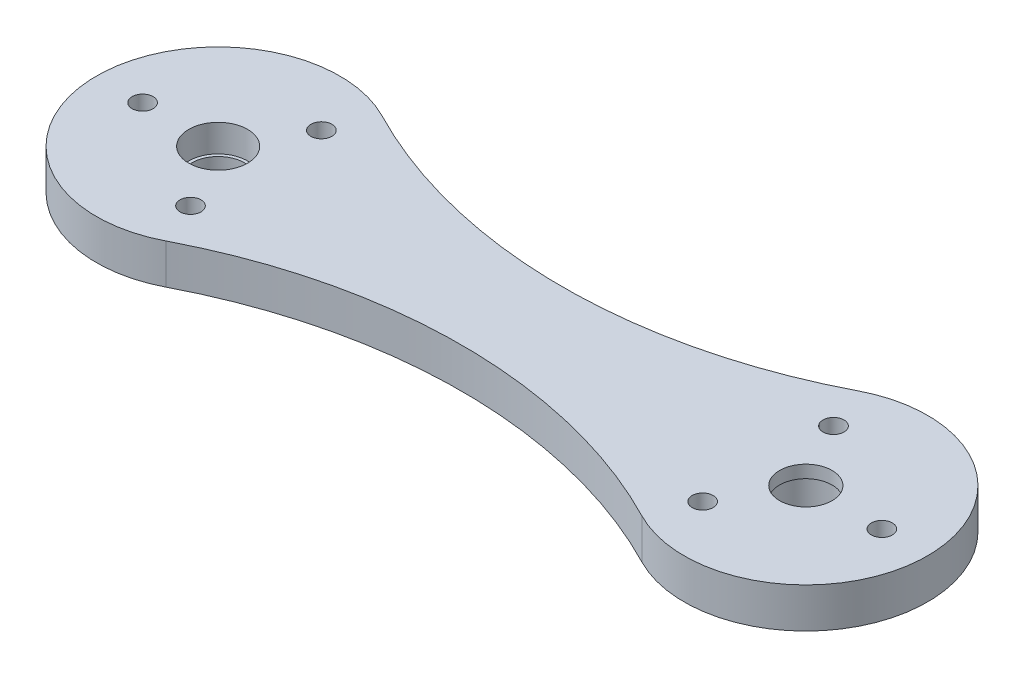
ISO-10303-21;
HEADER;
FILE_DESCRIPTION(('STEP AP214'),'2;1');
FILE_NAME('part.step','',(''),(''),'','','');
FILE_SCHEMA(('AUTOMOTIVE_DESIGN { 1 0 10303 214 1 1 1 1 }'));
ENDSEC;
DATA;
#1=APPLICATION_CONTEXT('core data for automotive mechanical design processes');
#2=APPLICATION_PROTOCOL_DEFINITION('international standard','automotive_design',2000,#1);
#3=PRODUCT_CONTEXT('',#1,'mechanical');
#4=PRODUCT('Part','Part','',(#3));
#5=PRODUCT_RELATED_PRODUCT_CATEGORY('part','',(#4));
#6=PRODUCT_DEFINITION_FORMATION('','',#4);
#7=PRODUCT_DEFINITION_CONTEXT('part definition',#1,'design');
#8=PRODUCT_DEFINITION('design','',#6,#7);
#9=PRODUCT_DEFINITION_SHAPE('','',#8);
#10=(LENGTH_UNIT() NAMED_UNIT(*) SI_UNIT(.MILLI.,.METRE.));
#11=(NAMED_UNIT(*) PLANE_ANGLE_UNIT() SI_UNIT($,.RADIAN.));
#12=(NAMED_UNIT(*) SI_UNIT($,.STERADIAN.) SOLID_ANGLE_UNIT());
#13=UNCERTAINTY_MEASURE_WITH_UNIT(LENGTH_MEASURE(1.E-05),#10,'distance_accuracy_value','');
#14=(GEOMETRIC_REPRESENTATION_CONTEXT(3) GLOBAL_UNCERTAINTY_ASSIGNED_CONTEXT((#13)) GLOBAL_UNIT_ASSIGNED_CONTEXT((#10,
#11,#12)) REPRESENTATION_CONTEXT('',''));
#15=CARTESIAN_POINT('',(0.,0.,0.));
#16=DIRECTION('',(0.,0.,1.));
#17=DIRECTION('',(1.,0.,0.));
#18=AXIS2_PLACEMENT_3D('',#15,#16,#17);
#19=CARTESIAN_POINT('',(0.,4.7625,-67.8088235294118));
#20=DIRECTION('',(0.,-1.,0.));
#21=DIRECTION('',(0.,0.,-1.));
#22=AXIS2_PLACEMENT_3D('',#19,#20,#21);
#23=CYLINDRICAL_SURFACE('',#22,61.8088235294118);
#24=CARTESIAN_POINT('',(0.,0.,-67.8088235294118));
#25=DIRECTION('',(0.,-1.,0.));
#26=DIRECTION('',(0.,0.,1.));
#27=AXIS2_PLACEMENT_3D('',#24,#25,#26);
#28=CIRCLE('',#27,61.8088235294118);
#29=CARTESIAN_POINT('',(28.3493929466179,0.,-12.8848525727501));
#30=VERTEX_POINT('',#29);
#31=CARTESIAN_POINT('',(-28.3493929466178,0.,-12.88485257275));
#32=VERTEX_POINT('',#31);
#33=EDGE_CURVE('E98',#30,#32,#28,.T.);
#34=ORIENTED_EDGE('',*,*,#33,.T.);
#35=DIRECTION('',(0.,-1.,0.));
#36=VECTOR('',#35,1.);
#37=CARTESIAN_POINT('',(-28.3493929466178,4.7625,-12.88485257275));
#38=LINE('',#37,#36);
#39=CARTESIAN_POINT('',(-28.3493929466178,4.7625,-12.88485257275));
#40=VERTEX_POINT('',#39);
#41=EDGE_CURVE('E12',#40,#32,#38,.T.);
#42=ORIENTED_EDGE('',*,*,#41,.F.);
#43=CARTESIAN_POINT('',(0.,4.7625,-67.8088235294118));
#44=DIRECTION('',(0.,-1.,0.));
#45=DIRECTION('',(0.,0.,1.));
#46=AXIS2_PLACEMENT_3D('',#43,#44,#45);
#47=CIRCLE('',#46,61.8088235294118);
#48=CARTESIAN_POINT('',(28.3493929466179,4.7625,-12.8848525727501));
#49=VERTEX_POINT('',#48);
#50=EDGE_CURVE('E85',#49,#40,#47,.T.);
#51=ORIENTED_EDGE('',*,*,#50,.F.);
#52=DIRECTION('',(0.,-1.,0.));
#53=VECTOR('',#52,1.);
#54=CARTESIAN_POINT('',(28.3493929466179,4.7625,-12.8848525727501));
#55=LINE('',#54,#53);
#56=EDGE_CURVE('E94',#49,#30,#55,.T.);
#57=ORIENTED_EDGE('',*,*,#56,.T.);
#58=EDGE_LOOP('',(#34,#42,#51,#57));
#59=FACE_BOUND('',#58,.T.);
#60=ADVANCED_FACE('F33',(#59),#23,.F.);
#61=CARTESIAN_POINT('',(-35.,4.7625,0.));
#62=DIRECTION('',(0.,-1.,0.));
#63=DIRECTION('',(0.,0.,-1.));
#64=AXIS2_PLACEMENT_3D('',#61,#62,#63);
#65=CYLINDRICAL_SURFACE('',#64,14.5);
#66=CARTESIAN_POINT('',(-35.,0.,0.));
#67=DIRECTION('',(0.,1.,0.));
#68=DIRECTION('',(0.,0.,1.));
#69=AXIS2_PLACEMENT_3D('',#66,#67,#68);
#70=CIRCLE('',#69,14.5);
#71=CARTESIAN_POINT('',(-28.3493929466179,0.,12.8848525727501));
#72=VERTEX_POINT('',#71);
#73=EDGE_CURVE('E89',#32,#72,#70,.T.);
#74=ORIENTED_EDGE('',*,*,#73,.T.);
#75=DIRECTION('',(0.,-1.,0.));
#76=VECTOR('',#75,1.);
#77=CARTESIAN_POINT('',(-28.3493929466179,4.7625,12.8848525727501));
#78=LINE('',#77,#76);
#79=CARTESIAN_POINT('',(-28.3493929466179,4.7625,12.8848525727501));
#80=VERTEX_POINT('',#79);
#81=EDGE_CURVE('E42',#80,#72,#78,.T.);
#82=ORIENTED_EDGE('',*,*,#81,.F.);
#83=CARTESIAN_POINT('',(-35.,4.7625,0.));
#84=DIRECTION('',(0.,1.,0.));
#85=DIRECTION('',(0.,0.,1.));
#86=AXIS2_PLACEMENT_3D('',#83,#84,#85);
#87=CIRCLE('',#86,14.5);
#88=EDGE_CURVE('E80',#40,#80,#87,.T.);
#89=ORIENTED_EDGE('',*,*,#88,.F.);
#90=ORIENTED_EDGE('',*,*,#41,.T.);
#91=EDGE_LOOP('',(#74,#82,#89,#90));
#92=FACE_BOUND('',#91,.T.);
#93=ADVANCED_FACE('F88',(#92),#65,.T.);
#94=CARTESIAN_POINT('',(0.,4.7625,67.8088235294118));
#95=DIRECTION('',(0.,-1.,0.));
#96=DIRECTION('',(0.,0.,-1.));
#97=AXIS2_PLACEMENT_3D('',#94,#95,#96);
#98=CYLINDRICAL_SURFACE('',#97,61.8088235294118);
#99=CARTESIAN_POINT('',(0.,0.,67.8088235294118));
#100=DIRECTION('',(0.,-1.,0.));
#101=DIRECTION('',(0.,0.,-1.));
#102=AXIS2_PLACEMENT_3D('',#99,#100,#101);
#103=CIRCLE('',#102,61.8088235294118);
#104=CARTESIAN_POINT('',(28.3493929466178,0.,12.88485257275));
#105=VERTEX_POINT('',#104);
#106=EDGE_CURVE('E67',#72,#105,#103,.T.);
#107=ORIENTED_EDGE('',*,*,#106,.T.);
#108=DIRECTION('',(0.,-1.,0.));
#109=VECTOR('',#108,1.);
#110=CARTESIAN_POINT('',(28.3493929466178,4.7625,12.88485257275));
#111=LINE('',#110,#109);
#112=CARTESIAN_POINT('',(28.3493929466178,4.7625,12.88485257275));
#113=VERTEX_POINT('',#112);
#114=EDGE_CURVE('E90',#113,#105,#111,.T.);
#115=ORIENTED_EDGE('',*,*,#114,.F.);
#116=CARTESIAN_POINT('',(0.,4.7625,67.8088235294118));
#117=DIRECTION('',(0.,-1.,0.));
#118=DIRECTION('',(0.,0.,-1.));
#119=AXIS2_PLACEMENT_3D('',#116,#117,#118);
#120=CIRCLE('',#119,61.8088235294118);
#121=EDGE_CURVE('E83',#80,#113,#120,.T.);
#122=ORIENTED_EDGE('',*,*,#121,.F.);
#123=ORIENTED_EDGE('',*,*,#81,.T.);
#124=EDGE_LOOP('',(#107,#115,#122,#123));
#125=FACE_BOUND('',#124,.T.);
#126=ADVANCED_FACE('F92',(#125),#98,.F.);
#127=CARTESIAN_POINT('',(35.,4.7625,0.));
#128=DIRECTION('',(0.,-1.,0.));
#129=DIRECTION('',(0.,0.,-1.));
#130=AXIS2_PLACEMENT_3D('',#127,#128,#129);
#131=CYLINDRICAL_SURFACE('',#130,14.5);
#132=CARTESIAN_POINT('',(35.,0.,0.));
#133=DIRECTION('',(0.,1.,0.));
#134=DIRECTION('',(0.,0.,1.));
#135=AXIS2_PLACEMENT_3D('',#132,#133,#134);
#136=CIRCLE('',#135,14.5);
#137=EDGE_CURVE('E73',#105,#30,#136,.T.);
#138=ORIENTED_EDGE('',*,*,#137,.T.);
#139=ORIENTED_EDGE('',*,*,#56,.F.);
#140=CARTESIAN_POINT('',(35.,4.7625,0.));
#141=DIRECTION('',(0.,1.,0.));
#142=DIRECTION('',(0.,0.,1.));
#143=AXIS2_PLACEMENT_3D('',#140,#141,#142);
#144=CIRCLE('',#143,14.5);
#145=EDGE_CURVE('E50',#113,#49,#144,.T.);
#146=ORIENTED_EDGE('',*,*,#145,.F.);
#147=ORIENTED_EDGE('',*,*,#114,.T.);
#148=EDGE_LOOP('',(#138,#139,#146,#147));
#149=FACE_BOUND('',#148,.T.);
#150=ADVANCED_FACE('F106',(#149),#131,.T.);
#151=CARTESIAN_POINT('',(17.5,4.7625,-33.9044117647059));
#152=DIRECTION('',(0.,1.,0.));
#153=DIRECTION('',(0.,0.,1.));
#154=AXIS2_PLACEMENT_3D('',#151,#152,#153);
#155=PLANE('',#154);
#156=CARTESIAN_POINT('',(43.9998489219817,4.7625,-0.0521476893535139));
#157=DIRECTION('',(0.,-1.,0.));
#158=DIRECTION('',(0.,0.,-1.));
#159=AXIS2_PLACEMENT_3D('',#156,#157,#158);
#160=CIRCLE('',#159,1.25);
#161=CARTESIAN_POINT('',(43.9998489219817,4.7625,-1.30214768935352));
#162=VERTEX_POINT('',#161);
#163=EDGE_CURVE('E162',#162,#162,#160,.T.);
#164=ORIENTED_EDGE('',*,*,#163,.T.);
#165=EDGE_LOOP('',(#164));
#166=FACE_BOUND('',#165,.T.);
#167=CARTESIAN_POINT('',(30.5,4.7625,7.79422863405996));
#168=DIRECTION('',(0.,-1.,0.));
#169=DIRECTION('',(0.,0.,-1.));
#170=AXIS2_PLACEMENT_3D('',#167,#168,#169);
#171=CIRCLE('',#170,1.25);
#172=CARTESIAN_POINT('',(30.5,4.7625,6.54422863405996));
#173=VERTEX_POINT('',#172);
#174=EDGE_CURVE('E156',#173,#173,#171,.T.);
#175=ORIENTED_EDGE('',*,*,#174,.T.);
#176=EDGE_LOOP('',(#175));
#177=FACE_BOUND('',#176,.T.);
#178=CARTESIAN_POINT('',(30.5,4.7625,-7.79422863405996));
#179=DIRECTION('',(0.,-1.,0.));
#180=DIRECTION('',(0.,0.,-1.));
#181=AXIS2_PLACEMENT_3D('',#178,#179,#180);
#182=CIRCLE('',#181,1.25);
#183=CARTESIAN_POINT('',(30.5,4.7625,-9.04422863405996));
#184=VERTEX_POINT('',#183);
#185=EDGE_CURVE('E150',#184,#184,#182,.T.);
#186=ORIENTED_EDGE('',*,*,#185,.T.);
#187=EDGE_LOOP('',(#186));
#188=FACE_BOUND('',#187,.T.);
#189=CARTESIAN_POINT('',(-30.5,4.7625,7.79422863405996));
#190=DIRECTION('',(0.,1.,0.));
#191=DIRECTION('',(0.,0.,1.));
#192=AXIS2_PLACEMENT_3D('',#189,#190,#191);
#193=CIRCLE('',#192,1.24999999999999);
#194=CARTESIAN_POINT('',(-30.5,4.7625,9.04422863405994));
#195=VERTEX_POINT('',#194);
#196=EDGE_CURVE('E147',#195,#195,#193,.T.);
#197=ORIENTED_EDGE('',*,*,#196,.F.);
#198=EDGE_LOOP('',(#197));
#199=FACE_BOUND('',#198,.T.);
#200=CARTESIAN_POINT('',(-44.,4.7625,0.));
#201=DIRECTION('',(0.,1.,0.));
#202=DIRECTION('',(0.,0.,1.));
#203=AXIS2_PLACEMENT_3D('',#200,#201,#202);
#204=CIRCLE('',#203,1.24999999999999);
#205=CARTESIAN_POINT('',(-44.,4.7625,1.24999999999999));
#206=VERTEX_POINT('',#205);
#207=EDGE_CURVE('E141',#206,#206,#204,.T.);
#208=ORIENTED_EDGE('',*,*,#207,.F.);
#209=EDGE_LOOP('',(#208));
#210=FACE_BOUND('',#209,.T.);
#211=CARTESIAN_POINT('',(-30.5,4.7625,-7.79422863405996));
#212=DIRECTION('',(0.,1.,0.));
#213=DIRECTION('',(0.,0.,1.));
#214=AXIS2_PLACEMENT_3D('',#211,#212,#213);
#215=CIRCLE('',#214,1.24999999999999);
#216=CARTESIAN_POINT('',(-30.5,4.7625,-6.54422863405997));
#217=VERTEX_POINT('',#216);
#218=EDGE_CURVE('E135',#217,#217,#215,.T.);
#219=ORIENTED_EDGE('',*,*,#218,.F.);
#220=EDGE_LOOP('',(#219));
#221=FACE_BOUND('',#220,.T.);
#222=CARTESIAN_POINT('',(35.,4.7625,0.));
#223=DIRECTION('',(0.,-1.,0.));
#224=DIRECTION('',(0.,0.,-1.));
#225=AXIS2_PLACEMENT_3D('',#222,#223,#224);
#226=CIRCLE('',#225,3.125);
#227=CARTESIAN_POINT('',(35.,4.7625,-3.125));
#228=VERTEX_POINT('',#227);
#229=EDGE_CURVE('E121',#228,#228,#226,.T.);
#230=ORIENTED_EDGE('',*,*,#229,.T.);
#231=EDGE_LOOP('',(#230));
#232=FACE_BOUND('',#231,.T.);
#233=CARTESIAN_POINT('',(-35.,4.7625,0.));
#234=DIRECTION('',(0.,1.,0.));
#235=DIRECTION('',(0.,0.,1.));
#236=AXIS2_PLACEMENT_3D('',#233,#234,#235);
#237=CIRCLE('',#236,3.5);
#238=CARTESIAN_POINT('',(-35.,4.7625,3.5));
#239=VERTEX_POINT('',#238);
#240=EDGE_CURVE('E114',#239,#239,#237,.T.);
#241=ORIENTED_EDGE('',*,*,#240,.F.);
#242=EDGE_LOOP('',(#241));
#243=FACE_BOUND('',#242,.T.);
#244=ORIENTED_EDGE('',*,*,#50,.T.);
#245=ORIENTED_EDGE('',*,*,#88,.T.);
#246=ORIENTED_EDGE('',*,*,#121,.T.);
#247=ORIENTED_EDGE('',*,*,#145,.T.);
#248=EDGE_LOOP('',(#244,#245,#246,#247));
#249=FACE_BOUND('',#248,.T.);
#250=ADVANCED_FACE('F81',(#166,#177,#188,#199,#210,#221,#232,#243,#249),#155,.T.);
#251=CARTESIAN_POINT('',(17.5,0.,-33.9044117647059));
#252=DIRECTION('',(0.,1.,0.));
#253=DIRECTION('',(0.,0.,1.));
#254=AXIS2_PLACEMENT_3D('',#251,#252,#253);
#255=PLANE('',#254);
#256=CARTESIAN_POINT('',(43.9998489219817,0.,-0.0521476893535139));
#257=DIRECTION('',(0.,-1.,0.));
#258=DIRECTION('',(0.,0.,-1.));
#259=AXIS2_PLACEMENT_3D('',#256,#257,#258);
#260=CIRCLE('',#259,1.24999999999999);
#261=CARTESIAN_POINT('',(43.9998489219817,0.,-1.3021476893535));
#262=VERTEX_POINT('',#261);
#263=EDGE_CURVE('E165',#262,#262,#260,.T.);
#264=ORIENTED_EDGE('',*,*,#263,.F.);
#265=EDGE_LOOP('',(#264));
#266=FACE_BOUND('',#265,.T.);
#267=CARTESIAN_POINT('',(30.5,0.,7.79422863405996));
#268=DIRECTION('',(0.,-1.,0.));
#269=DIRECTION('',(0.,0.,-1.));
#270=AXIS2_PLACEMENT_3D('',#267,#268,#269);
#271=CIRCLE('',#270,1.24999999999999);
#272=CARTESIAN_POINT('',(30.5,0.,6.54422863405997));
#273=VERTEX_POINT('',#272);
#274=EDGE_CURVE('E159',#273,#273,#271,.T.);
#275=ORIENTED_EDGE('',*,*,#274,.F.);
#276=EDGE_LOOP('',(#275));
#277=FACE_BOUND('',#276,.T.);
#278=CARTESIAN_POINT('',(30.5,0.,-7.79422863405996));
#279=DIRECTION('',(0.,-1.,0.));
#280=DIRECTION('',(0.,0.,-1.));
#281=AXIS2_PLACEMENT_3D('',#278,#279,#280);
#282=CIRCLE('',#281,1.24999999999999);
#283=CARTESIAN_POINT('',(30.5,0.,-9.04422863405995));
#284=VERTEX_POINT('',#283);
#285=EDGE_CURVE('E153',#284,#284,#282,.T.);
#286=ORIENTED_EDGE('',*,*,#285,.F.);
#287=EDGE_LOOP('',(#286));
#288=FACE_BOUND('',#287,.T.);
#289=CARTESIAN_POINT('',(-30.5,0.,7.79422863405996));
#290=DIRECTION('',(0.,1.,0.));
#291=DIRECTION('',(0.,0.,1.));
#292=AXIS2_PLACEMENT_3D('',#289,#290,#291);
#293=CIRCLE('',#292,1.25);
#294=CARTESIAN_POINT('',(-30.5,0.,9.04422863405996));
#295=VERTEX_POINT('',#294);
#296=EDGE_CURVE('E144',#295,#295,#293,.T.);
#297=ORIENTED_EDGE('',*,*,#296,.T.);
#298=EDGE_LOOP('',(#297));
#299=FACE_BOUND('',#298,.T.);
#300=CARTESIAN_POINT('',(-44.,0.,0.));
#301=DIRECTION('',(0.,1.,0.));
#302=DIRECTION('',(0.,0.,1.));
#303=AXIS2_PLACEMENT_3D('',#300,#301,#302);
#304=CIRCLE('',#303,1.25);
#305=CARTESIAN_POINT('',(-44.,0.,1.25));
#306=VERTEX_POINT('',#305);
#307=EDGE_CURVE('E138',#306,#306,#304,.T.);
#308=ORIENTED_EDGE('',*,*,#307,.T.);
#309=EDGE_LOOP('',(#308));
#310=FACE_BOUND('',#309,.T.);
#311=CARTESIAN_POINT('',(-30.5,0.,-7.79422863405996));
#312=DIRECTION('',(0.,1.,0.));
#313=DIRECTION('',(0.,0.,1.));
#314=AXIS2_PLACEMENT_3D('',#311,#312,#313);
#315=CIRCLE('',#314,1.25);
#316=CARTESIAN_POINT('',(-30.5,0.,-6.54422863405996));
#317=VERTEX_POINT('',#316);
#318=EDGE_CURVE('E132',#317,#317,#315,.T.);
#319=ORIENTED_EDGE('',*,*,#318,.T.);
#320=EDGE_LOOP('',(#319));
#321=FACE_BOUND('',#320,.T.);
#322=CARTESIAN_POINT('',(35.,0.,0.));
#323=DIRECTION('',(0.,-1.,0.));
#324=DIRECTION('',(0.,0.,-1.));
#325=AXIS2_PLACEMENT_3D('',#322,#323,#324);
#326=CIRCLE('',#325,3.5);
#327=CARTESIAN_POINT('',(35.,0.,-3.5));
#328=VERTEX_POINT('',#327);
#329=EDGE_CURVE('E129',#328,#328,#326,.T.);
#330=ORIENTED_EDGE('',*,*,#329,.F.);
#331=EDGE_LOOP('',(#330));
#332=FACE_BOUND('',#331,.T.);
#333=CARTESIAN_POINT('',(-35.,0.,0.));
#334=DIRECTION('',(0.,1.,0.));
#335=DIRECTION('',(0.,0.,1.));
#336=AXIS2_PLACEMENT_3D('',#333,#334,#335);
#337=CIRCLE('',#336,3.125);
#338=CARTESIAN_POINT('',(-35.,0.,3.125));
#339=VERTEX_POINT('',#338);
#340=EDGE_CURVE('E117',#339,#339,#337,.T.);
#341=ORIENTED_EDGE('',*,*,#340,.T.);
#342=EDGE_LOOP('',(#341));
#343=FACE_BOUND('',#342,.T.);
#344=ORIENTED_EDGE('',*,*,#33,.F.);
#345=ORIENTED_EDGE('',*,*,#137,.F.);
#346=ORIENTED_EDGE('',*,*,#106,.F.);
#347=ORIENTED_EDGE('',*,*,#73,.F.);
#348=EDGE_LOOP('',(#344,#345,#346,#347));
#349=FACE_BOUND('',#348,.T.);
#350=ADVANCED_FACE('F109',(#266,#277,#288,#299,#310,#321,#332,#343,#349),#255,.F.);
#351=CARTESIAN_POINT('',(-35.,-9.89949493661167,0.));
#352=DIRECTION('',(0.,1.,0.));
#353=DIRECTION('',(0.,0.,1.));
#354=AXIS2_PLACEMENT_3D('',#351,#352,#353);
#355=CYLINDRICAL_SURFACE('',#354,3.5);
#356=CARTESIAN_POINT('',(-35.,1.5,0.));
#357=DIRECTION('',(0.,1.,0.));
#358=DIRECTION('',(0.,0.,1.));
#359=AXIS2_PLACEMENT_3D('',#356,#357,#358);
#360=CIRCLE('',#359,3.5);
#361=CARTESIAN_POINT('',(-35.,1.5,3.5));
#362=VERTEX_POINT('',#361);
#363=EDGE_CURVE('E101',#362,#362,#360,.F.);
#364=ORIENTED_EDGE('',*,*,#363,.T.);
#365=EDGE_LOOP('',(#364));
#366=FACE_BOUND('',#365,.T.);
#367=ORIENTED_EDGE('',*,*,#240,.T.);
#368=EDGE_LOOP('',(#367));
#369=FACE_BOUND('',#368,.T.);
#370=ADVANCED_FACE('F173',(#366,#369),#355,.F.);
#371=CARTESIAN_POINT('',(17.5,1.5,-33.9044117647059));
#372=DIRECTION('',(0.,1.,0.));
#373=DIRECTION('',(0.,0.,1.));
#374=AXIS2_PLACEMENT_3D('',#371,#372,#373);
#375=PLANE('',#374);
#376=CARTESIAN_POINT('',(-35.,1.5,0.));
#377=DIRECTION('',(0.,1.,0.));
#378=DIRECTION('',(0.,0.,1.));
#379=AXIS2_PLACEMENT_3D('',#376,#377,#378);
#380=CIRCLE('',#379,3.125);
#381=CARTESIAN_POINT('',(-35.,1.5,3.125));
#382=VERTEX_POINT('',#381);
#383=EDGE_CURVE('E118',#382,#382,#380,.T.);
#384=ORIENTED_EDGE('',*,*,#383,.F.);
#385=EDGE_LOOP('',(#384));
#386=FACE_BOUND('',#385,.T.);
#387=ORIENTED_EDGE('',*,*,#363,.F.);
#388=EDGE_LOOP('',(#387));
#389=FACE_BOUND('',#388,.T.);
#390=ADVANCED_FACE('F193',(#386,#389),#375,.T.);
#391=CARTESIAN_POINT('',(-35.,0.,0.));
#392=DIRECTION('',(0.,1.,0.));
#393=DIRECTION('',(0.,0.,1.));
#394=AXIS2_PLACEMENT_3D('',#391,#392,#393);
#395=CYLINDRICAL_SURFACE('',#394,3.125);
#396=ORIENTED_EDGE('',*,*,#340,.F.);
#397=EDGE_LOOP('',(#396));
#398=FACE_BOUND('',#397,.T.);
#399=ORIENTED_EDGE('',*,*,#383,.T.);
#400=EDGE_LOOP('',(#399));
#401=FACE_BOUND('',#400,.T.);
#402=ADVANCED_FACE('F189',(#398,#401),#395,.F.);
#403=CARTESIAN_POINT('',(35.,4.7625,0.));
#404=DIRECTION('',(0.,-1.,0.));
#405=DIRECTION('',(0.,0.,-1.));
#406=AXIS2_PLACEMENT_3D('',#403,#404,#405);
#407=CYLINDRICAL_SURFACE('',#406,3.125);
#408=CARTESIAN_POINT('',(35.,3.2625,0.));
#409=DIRECTION('',(0.,1.,0.));
#410=DIRECTION('',(0.,0.,1.));
#411=AXIS2_PLACEMENT_3D('',#408,#409,#410);
#412=CIRCLE('',#411,3.125);
#413=CARTESIAN_POINT('',(35.,3.2625,3.125));
#414=VERTEX_POINT('',#413);
#415=EDGE_CURVE('E36',#414,#414,#412,.F.);
#416=ORIENTED_EDGE('',*,*,#415,.T.);
#417=EDGE_LOOP('',(#416));
#418=FACE_BOUND('',#417,.T.);
#419=ORIENTED_EDGE('',*,*,#229,.F.);
#420=EDGE_LOOP('',(#419));
#421=FACE_BOUND('',#420,.T.);
#422=ADVANCED_FACE('F192',(#418,#421),#407,.F.);
#423=CARTESIAN_POINT('',(17.5,3.2625,-33.9044117647059));
#424=DIRECTION('',(0.,1.,0.));
#425=DIRECTION('',(0.,0.,1.));
#426=AXIS2_PLACEMENT_3D('',#423,#424,#425);
#427=PLANE('',#426);
#428=CARTESIAN_POINT('',(35.,3.2625,0.));
#429=DIRECTION('',(0.,1.,0.));
#430=DIRECTION('',(0.,0.,1.));
#431=AXIS2_PLACEMENT_3D('',#428,#429,#430);
#432=CIRCLE('',#431,3.5);
#433=CARTESIAN_POINT('',(35.,3.2625,3.5));
#434=VERTEX_POINT('',#433);
#435=EDGE_CURVE('E126',#434,#434,#432,.F.);
#436=ORIENTED_EDGE('',*,*,#435,.T.);
#437=EDGE_LOOP('',(#436));
#438=FACE_BOUND('',#437,.T.);
#439=ORIENTED_EDGE('',*,*,#415,.F.);
#440=EDGE_LOOP('',(#439));
#441=FACE_BOUND('',#440,.T.);
#442=ADVANCED_FACE('F258',(#438,#441),#427,.F.);
#443=CARTESIAN_POINT('',(35.,14.6619949366117,0.));
#444=DIRECTION('',(0.,-1.,0.));
#445=DIRECTION('',(0.,0.,-1.));
#446=AXIS2_PLACEMENT_3D('',#443,#444,#445);
#447=CYLINDRICAL_SURFACE('',#446,3.5);
#448=ORIENTED_EDGE('',*,*,#329,.T.);
#449=EDGE_LOOP('',(#448));
#450=FACE_BOUND('',#449,.T.);
#451=ORIENTED_EDGE('',*,*,#435,.F.);
#452=EDGE_LOOP('',(#451));
#453=FACE_BOUND('',#452,.T.);
#454=ADVANCED_FACE('F268',(#450,#453),#447,.F.);
#455=CARTESIAN_POINT('',(-30.5,4.7625,-7.79422863405996));
#456=DIRECTION('',(0.,1.,0.));
#457=DIRECTION('',(0.,0.,1.));
#458=AXIS2_PLACEMENT_3D('',#455,#456,#457);
#459=CYLINDRICAL_SURFACE('',#458,1.24999999999999);
#460=ORIENTED_EDGE('',*,*,#318,.F.);
#461=EDGE_LOOP('',(#460));
#462=FACE_BOUND('',#461,.T.);
#463=ORIENTED_EDGE('',*,*,#218,.T.);
#464=EDGE_LOOP('',(#463));
#465=FACE_BOUND('',#464,.T.);
#466=ADVANCED_FACE('F278',(#462,#465),#459,.F.);
#467=CARTESIAN_POINT('',(-44.,4.7625,0.));
#468=DIRECTION('',(0.,1.,0.));
#469=DIRECTION('',(0.,0.,1.));
#470=AXIS2_PLACEMENT_3D('',#467,#468,#469);
#471=CYLINDRICAL_SURFACE('',#470,1.24999999999999);
#472=ORIENTED_EDGE('',*,*,#307,.F.);
#473=EDGE_LOOP('',(#472));
#474=FACE_BOUND('',#473,.T.);
#475=ORIENTED_EDGE('',*,*,#207,.T.);
#476=EDGE_LOOP('',(#475));
#477=FACE_BOUND('',#476,.T.);
#478=ADVANCED_FACE('F288',(#474,#477),#471,.F.);
#479=CARTESIAN_POINT('',(-30.5,4.7625,7.79422863405996));
#480=DIRECTION('',(0.,1.,0.));
#481=DIRECTION('',(0.,0.,1.));
#482=AXIS2_PLACEMENT_3D('',#479,#480,#481);
#483=CYLINDRICAL_SURFACE('',#482,1.24999999999999);
#484=ORIENTED_EDGE('',*,*,#296,.F.);
#485=EDGE_LOOP('',(#484));
#486=FACE_BOUND('',#485,.T.);
#487=ORIENTED_EDGE('',*,*,#196,.T.);
#488=EDGE_LOOP('',(#487));
#489=FACE_BOUND('',#488,.T.);
#490=ADVANCED_FACE('F298',(#486,#489),#483,.F.);
#491=CARTESIAN_POINT('',(30.5,0.,-7.79422863405996));
#492=DIRECTION('',(0.,-1.,0.));
#493=DIRECTION('',(0.,0.,-1.));
#494=AXIS2_PLACEMENT_3D('',#491,#492,#493);
#495=CYLINDRICAL_SURFACE('',#494,1.24999999999999);
#496=ORIENTED_EDGE('',*,*,#185,.F.);
#497=EDGE_LOOP('',(#496));
#498=FACE_BOUND('',#497,.T.);
#499=ORIENTED_EDGE('',*,*,#285,.T.);
#500=EDGE_LOOP('',(#499));
#501=FACE_BOUND('',#500,.T.);
#502=ADVANCED_FACE('F307',(#498,#501),#495,.F.);
#503=CARTESIAN_POINT('',(30.5,0.,7.79422863405996));
#504=DIRECTION('',(0.,-1.,0.));
#505=DIRECTION('',(0.,0.,-1.));
#506=AXIS2_PLACEMENT_3D('',#503,#504,#505);
#507=CYLINDRICAL_SURFACE('',#506,1.24999999999999);
#508=ORIENTED_EDGE('',*,*,#174,.F.);
#509=EDGE_LOOP('',(#508));
#510=FACE_BOUND('',#509,.T.);
#511=ORIENTED_EDGE('',*,*,#274,.T.);
#512=EDGE_LOOP('',(#511));
#513=FACE_BOUND('',#512,.T.);
#514=ADVANCED_FACE('F326',(#510,#513),#507,.F.);
#515=CARTESIAN_POINT('',(43.9998489219817,0.,-0.0521476893535139));
#516=DIRECTION('',(0.,-1.,0.));
#517=DIRECTION('',(0.,0.,-1.));
#518=AXIS2_PLACEMENT_3D('',#515,#516,#517);
#519=CYLINDRICAL_SURFACE('',#518,1.24999999999999);
#520=ORIENTED_EDGE('',*,*,#163,.F.);
#521=EDGE_LOOP('',(#520));
#522=FACE_BOUND('',#521,.T.);
#523=ORIENTED_EDGE('',*,*,#263,.T.);
#524=EDGE_LOOP('',(#523));
#525=FACE_BOUND('',#524,.T.);
#526=ADVANCED_FACE('F169',(#522,#525),#519,.F.);
#527=CLOSED_SHELL('',(#60,#93,#126,#150,#250,#350,#370,#390,#402,#422,#442,#454,#466,#478,#490,
#502,#514,#526));
#528=MANIFOLD_SOLID_BREP('B2',#527);
#529=ADVANCED_BREP_SHAPE_REPRESENTATION('',(#18,#528),#14);
#530=SHAPE_DEFINITION_REPRESENTATION(#9,#529);
ENDSEC;
END-ISO-10303-21;
